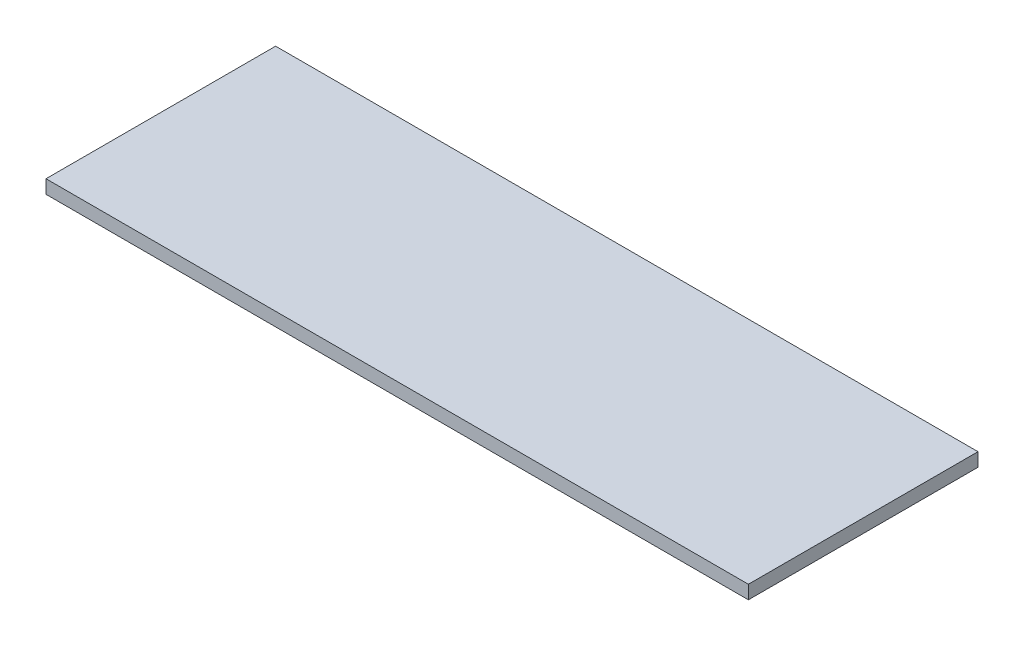
ISO-10303-21;
HEADER;
FILE_DESCRIPTION(('STEP AP214'),'2;1');
FILE_NAME('part.step','',(''),(''),'','','');
FILE_SCHEMA(('AUTOMOTIVE_DESIGN { 1 0 10303 214 1 1 1 1 }'));
ENDSEC;
DATA;
#1=APPLICATION_CONTEXT('core data for automotive mechanical design processes');
#2=APPLICATION_PROTOCOL_DEFINITION('international standard','automotive_design',2000,#1);
#3=PRODUCT_CONTEXT('',#1,'mechanical');
#4=PRODUCT('Part','Part','',(#3));
#5=PRODUCT_RELATED_PRODUCT_CATEGORY('part','',(#4));
#6=PRODUCT_DEFINITION_FORMATION('','',#4);
#7=PRODUCT_DEFINITION_CONTEXT('part definition',#1,'design');
#8=PRODUCT_DEFINITION('design','',#6,#7);
#9=PRODUCT_DEFINITION_SHAPE('','',#8);
#10=(LENGTH_UNIT() NAMED_UNIT(*) SI_UNIT(.MILLI.,.METRE.));
#11=(NAMED_UNIT(*) PLANE_ANGLE_UNIT() SI_UNIT($,.RADIAN.));
#12=(NAMED_UNIT(*) SI_UNIT($,.STERADIAN.) SOLID_ANGLE_UNIT());
#13=UNCERTAINTY_MEASURE_WITH_UNIT(LENGTH_MEASURE(1.E-05),#10,'distance_accuracy_value','');
#14=(GEOMETRIC_REPRESENTATION_CONTEXT(3) GLOBAL_UNCERTAINTY_ASSIGNED_CONTEXT((#13)) GLOBAL_UNIT_ASSIGNED_CONTEXT((#10,
#11,#12)) REPRESENTATION_CONTEXT('',''));
#15=CARTESIAN_POINT('',(0.,0.,0.));
#16=DIRECTION('',(0.,0.,1.));
#17=DIRECTION('',(1.,0.,0.));
#18=AXIS2_PLACEMENT_3D('',#15,#16,#17);
#19=CARTESIAN_POINT('',(-29.0397509588534,1.,-1.61520190023753));
#20=DIRECTION('',(1.,0.,0.));
#21=DIRECTION('',(0.,0.,-1.));
#22=AXIS2_PLACEMENT_3D('',#19,#20,#21);
#23=PLANE('',#22);
#24=DIRECTION('',(0.,0.,1.));
#25=VECTOR('',#24,1.);
#26=CARTESIAN_POINT('',(-29.0397509588534,0.,-1.61520190023753));
#27=LINE('',#26,#25);
#28=CARTESIAN_POINT('',(-29.0397509588534,0.,-1.61520190023753));
#29=VERTEX_POINT('',#28);
#30=CARTESIAN_POINT('',(-29.0397509588534,0.,15.3847980997625));
#31=VERTEX_POINT('',#30);
#32=EDGE_CURVE('E99',#29,#31,#27,.T.);
#33=ORIENTED_EDGE('',*,*,#32,.T.);
#34=DIRECTION('',(0.,-1.,0.));
#35=VECTOR('',#34,1.);
#36=CARTESIAN_POINT('',(-29.0397509588534,1.,15.3847980997625));
#37=LINE('',#36,#35);
#38=CARTESIAN_POINT('',(-29.0397509588534,1.,15.3847980997625));
#39=VERTEX_POINT('',#38);
#40=EDGE_CURVE('E11',#39,#31,#37,.T.);
#41=ORIENTED_EDGE('',*,*,#40,.F.);
#42=DIRECTION('',(0.,0.,1.));
#43=VECTOR('',#42,1.);
#44=CARTESIAN_POINT('',(-29.0397509588534,1.,-1.61520190023753));
#45=LINE('',#44,#43);
#46=CARTESIAN_POINT('',(-29.0397509588534,1.,-1.61520190023753));
#47=VERTEX_POINT('',#46);
#48=EDGE_CURVE('E87',#47,#39,#45,.T.);
#49=ORIENTED_EDGE('',*,*,#48,.F.);
#50=DIRECTION('',(0.,-1.,0.));
#51=VECTOR('',#50,1.);
#52=CARTESIAN_POINT('',(-29.0397509588534,1.,-1.61520190023753));
#53=LINE('',#52,#51);
#54=EDGE_CURVE('E95',#47,#29,#53,.T.);
#55=ORIENTED_EDGE('',*,*,#54,.T.);
#56=EDGE_LOOP('',(#33,#41,#49,#55));
#57=FACE_BOUND('',#56,.T.);
#58=ADVANCED_FACE('F36',(#57),#23,.F.);
#59=CARTESIAN_POINT('',(-29.0397509588534,1.,15.3847980997625));
#60=DIRECTION('',(0.,0.,-1.));
#61=DIRECTION('',(-1.,0.,0.));
#62=AXIS2_PLACEMENT_3D('',#59,#60,#61);
#63=PLANE('',#62);
#64=DIRECTION('',(1.,0.,0.));
#65=VECTOR('',#64,1.);
#66=CARTESIAN_POINT('',(-29.0397509588534,0.,15.3847980997625));
#67=LINE('',#66,#65);
#68=CARTESIAN_POINT('',(22.9602490411466,0.,15.3847980997625));
#69=VERTEX_POINT('',#68);
#70=EDGE_CURVE('E91',#31,#69,#67,.T.);
#71=ORIENTED_EDGE('',*,*,#70,.T.);
#72=DIRECTION('',(0.,-1.,0.));
#73=VECTOR('',#72,1.);
#74=CARTESIAN_POINT('',(22.9602490411466,1.,15.3847980997625));
#75=LINE('',#74,#73);
#76=CARTESIAN_POINT('',(22.9602490411466,1.,15.3847980997625));
#77=VERTEX_POINT('',#76);
#78=EDGE_CURVE('E44',#77,#69,#75,.T.);
#79=ORIENTED_EDGE('',*,*,#78,.F.);
#80=DIRECTION('',(1.,0.,0.));
#81=VECTOR('',#80,1.);
#82=CARTESIAN_POINT('',(-29.0397509588534,1.,15.3847980997625));
#83=LINE('',#82,#81);
#84=EDGE_CURVE('E82',#39,#77,#83,.T.);
#85=ORIENTED_EDGE('',*,*,#84,.F.);
#86=ORIENTED_EDGE('',*,*,#40,.T.);
#87=EDGE_LOOP('',(#71,#79,#85,#86));
#88=FACE_BOUND('',#87,.T.);
#89=ADVANCED_FACE('F90',(#88),#63,.F.);
#90=CARTESIAN_POINT('',(22.9602490411466,1.,-1.61520190023753));
#91=DIRECTION('',(-1.,0.,0.));
#92=DIRECTION('',(0.,0.,1.));
#93=AXIS2_PLACEMENT_3D('',#90,#91,#92);
#94=PLANE('',#93);
#95=DIRECTION('',(0.,0.,-1.));
#96=VECTOR('',#95,1.);
#97=CARTESIAN_POINT('',(22.9602490411466,0.,-1.61520190023753));
#98=LINE('',#97,#96);
#99=CARTESIAN_POINT('',(22.9602490411466,0.,-1.61520190023753));
#100=VERTEX_POINT('',#99);
#101=EDGE_CURVE('E69',#69,#100,#98,.T.);
#102=ORIENTED_EDGE('',*,*,#101,.T.);
#103=DIRECTION('',(0.,-1.,0.));
#104=VECTOR('',#103,1.);
#105=CARTESIAN_POINT('',(22.9602490411466,1.,-1.61520190023753));
#106=LINE('',#105,#104);
#107=CARTESIAN_POINT('',(22.9602490411466,1.,-1.61520190023753));
#108=VERTEX_POINT('',#107);
#109=EDGE_CURVE('E92',#108,#100,#106,.T.);
#110=ORIENTED_EDGE('',*,*,#109,.F.);
#111=DIRECTION('',(0.,0.,-1.));
#112=VECTOR('',#111,1.);
#113=CARTESIAN_POINT('',(22.9602490411466,1.,-1.61520190023753));
#114=LINE('',#113,#112);
#115=EDGE_CURVE('E85',#77,#108,#114,.T.);
#116=ORIENTED_EDGE('',*,*,#115,.F.);
#117=ORIENTED_EDGE('',*,*,#78,.T.);
#118=EDGE_LOOP('',(#102,#110,#116,#117));
#119=FACE_BOUND('',#118,.T.);
#120=ADVANCED_FACE('F93',(#119),#94,.F.);
#121=CARTESIAN_POINT('',(-29.0397509588534,1.,-1.61520190023753));
#122=DIRECTION('',(0.,0.,1.));
#123=DIRECTION('',(1.,0.,0.));
#124=AXIS2_PLACEMENT_3D('',#121,#122,#123);
#125=PLANE('',#124);
#126=DIRECTION('',(-1.,0.,0.));
#127=VECTOR('',#126,1.);
#128=CARTESIAN_POINT('',(-29.0397509588534,0.,-1.61520190023753));
#129=LINE('',#128,#127);
#130=EDGE_CURVE('E75',#100,#29,#129,.T.);
#131=ORIENTED_EDGE('',*,*,#130,.T.);
#132=ORIENTED_EDGE('',*,*,#54,.F.);
#133=DIRECTION('',(-1.,0.,0.));
#134=VECTOR('',#133,1.);
#135=CARTESIAN_POINT('',(-29.0397509588534,1.,-1.61520190023753));
#136=LINE('',#135,#134);
#137=EDGE_CURVE('E52',#108,#47,#136,.T.);
#138=ORIENTED_EDGE('',*,*,#137,.F.);
#139=ORIENTED_EDGE('',*,*,#109,.T.);
#140=EDGE_LOOP('',(#131,#132,#138,#139));
#141=FACE_BOUND('',#140,.T.);
#142=ADVANCED_FACE('F106',(#141),#125,.F.);
#143=CARTESIAN_POINT('',(0.,1.,0.));
#144=DIRECTION('',(0.,1.,0.));
#145=DIRECTION('',(0.,0.,1.));
#146=AXIS2_PLACEMENT_3D('',#143,#144,#145);
#147=PLANE('',#146);
#148=ORIENTED_EDGE('',*,*,#48,.T.);
#149=ORIENTED_EDGE('',*,*,#84,.T.);
#150=ORIENTED_EDGE('',*,*,#115,.T.);
#151=ORIENTED_EDGE('',*,*,#137,.T.);
#152=EDGE_LOOP('',(#148,#149,#150,#151));
#153=FACE_BOUND('',#152,.T.);
#154=ADVANCED_FACE('F83',(#153),#147,.T.);
#155=CARTESIAN_POINT('',(0.,0.,0.));
#156=DIRECTION('',(0.,1.,0.));
#157=DIRECTION('',(0.,0.,1.));
#158=AXIS2_PLACEMENT_3D('',#155,#156,#157);
#159=PLANE('',#158);
#160=ORIENTED_EDGE('',*,*,#32,.F.);
#161=ORIENTED_EDGE('',*,*,#130,.F.);
#162=ORIENTED_EDGE('',*,*,#101,.F.);
#163=ORIENTED_EDGE('',*,*,#70,.F.);
#164=EDGE_LOOP('',(#160,#161,#162,#163));
#165=FACE_BOUND('',#164,.T.);
#166=ADVANCED_FACE('F109',(#165),#159,.F.);
#167=CLOSED_SHELL('',(#58,#89,#120,#142,#154,#166));
#168=MANIFOLD_SOLID_BREP('B2',#167);
#169=ADVANCED_BREP_SHAPE_REPRESENTATION('',(#18,#168),#14);
#170=SHAPE_DEFINITION_REPRESENTATION(#9,#169);
ENDSEC;
END-ISO-10303-21;
